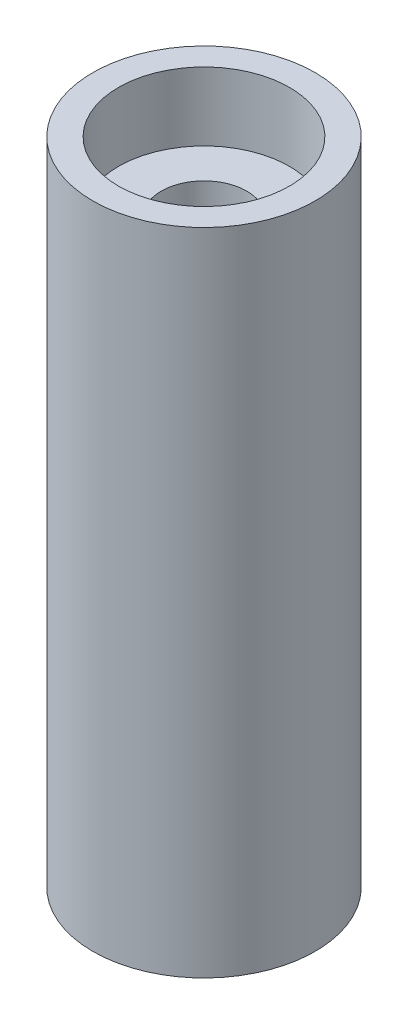
ISO-10303-21;
HEADER;
FILE_DESCRIPTION(('STEP AP214'),'2;1');
FILE_NAME('part.step','',(''),(''),'','','');
FILE_SCHEMA(('AUTOMOTIVE_DESIGN { 1 0 10303 214 1 1 1 1 }'));
ENDSEC;
DATA;
#1=APPLICATION_CONTEXT('core data for automotive mechanical design processes');
#2=APPLICATION_PROTOCOL_DEFINITION('international standard','automotive_design',2000,#1);
#3=PRODUCT_CONTEXT('',#1,'mechanical');
#4=PRODUCT('Part','Part','',(#3));
#5=PRODUCT_RELATED_PRODUCT_CATEGORY('part','',(#4));
#6=PRODUCT_DEFINITION_FORMATION('','',#4);
#7=PRODUCT_DEFINITION_CONTEXT('part definition',#1,'design');
#8=PRODUCT_DEFINITION('design','',#6,#7);
#9=PRODUCT_DEFINITION_SHAPE('','',#8);
#10=(LENGTH_UNIT() NAMED_UNIT(*) SI_UNIT(.MILLI.,.METRE.));
#11=(NAMED_UNIT(*) PLANE_ANGLE_UNIT() SI_UNIT($,.RADIAN.));
#12=(NAMED_UNIT(*) SI_UNIT($,.STERADIAN.) SOLID_ANGLE_UNIT());
#13=UNCERTAINTY_MEASURE_WITH_UNIT(LENGTH_MEASURE(1.E-05),#10,'distance_accuracy_value','');
#14=(GEOMETRIC_REPRESENTATION_CONTEXT(3) GLOBAL_UNCERTAINTY_ASSIGNED_CONTEXT((#13)) GLOBAL_UNIT_ASSIGNED_CONTEXT((#10,
#11,#12)) REPRESENTATION_CONTEXT('',''));
#15=CARTESIAN_POINT('',(0.,0.,0.));
#16=DIRECTION('',(0.,0.,1.));
#17=DIRECTION('',(1.,0.,0.));
#18=AXIS2_PLACEMENT_3D('',#15,#16,#17);
#19=CARTESIAN_POINT('',(0.,19.,0.));
#20=DIRECTION('',(0.,-1.,0.));
#21=DIRECTION('',(0.,0.,-1.));
#22=AXIS2_PLACEMENT_3D('',#19,#20,#21);
#23=CYLINDRICAL_SURFACE('',#22,2.5);
#24=CARTESIAN_POINT('',(0.,15.,0.));
#25=DIRECTION('',(0.,1.,0.));
#26=DIRECTION('',(0.,0.,1.));
#27=AXIS2_PLACEMENT_3D('',#24,#25,#26);
#28=CIRCLE('',#27,2.5);
#29=CARTESIAN_POINT('',(0.,15.,2.5));
#30=VERTEX_POINT('',#29);
#31=EDGE_CURVE('E47',#30,#30,#28,.T.);
#32=ORIENTED_EDGE('',*,*,#31,.T.);
#33=EDGE_LOOP('',(#32));
#34=FACE_BOUND('',#33,.T.);
#35=CARTESIAN_POINT('',(0.,-15.,0.));
#36=DIRECTION('',(0.,-1.,0.));
#37=DIRECTION('',(0.,0.,-1.));
#38=AXIS2_PLACEMENT_3D('',#35,#36,#37);
#39=CIRCLE('',#38,2.5);
#40=CARTESIAN_POINT('',(0.,-15.,-2.5));
#41=VERTEX_POINT('',#40);
#42=EDGE_CURVE('E38',#41,#41,#39,.T.);
#43=ORIENTED_EDGE('',*,*,#42,.T.);
#44=EDGE_LOOP('',(#43));
#45=FACE_BOUND('',#44,.T.);
#46=ADVANCED_FACE('F34',(#34,#45),#23,.F.);
#47=CARTESIAN_POINT('',(0.,-19.,0.));
#48=DIRECTION('',(0.,1.,0.));
#49=DIRECTION('',(0.,0.,1.));
#50=AXIS2_PLACEMENT_3D('',#47,#48,#49);
#51=PLANE('',#50);
#52=CARTESIAN_POINT('',(0.,-19.,0.));
#53=DIRECTION('',(0.,1.,0.));
#54=DIRECTION('',(0.,0.,1.));
#55=AXIS2_PLACEMENT_3D('',#52,#53,#54);
#56=CIRCLE('',#55,6.5);
#57=CARTESIAN_POINT('',(0.,-19.,6.5));
#58=VERTEX_POINT('',#57);
#59=EDGE_CURVE('E42',#58,#58,#56,.T.);
#60=ORIENTED_EDGE('',*,*,#59,.F.);
#61=EDGE_LOOP('',(#60));
#62=FACE_BOUND('',#61,.T.);
#63=CARTESIAN_POINT('',(0.,-19.,0.));
#64=DIRECTION('',(0.,1.,0.));
#65=DIRECTION('',(0.,0.,1.));
#66=AXIS2_PLACEMENT_3D('',#63,#64,#65);
#67=CIRCLE('',#66,5.);
#68=CARTESIAN_POINT('',(0.,-19.,5.));
#69=VERTEX_POINT('',#68);
#70=EDGE_CURVE('E61',#69,#69,#67,.T.);
#71=ORIENTED_EDGE('',*,*,#70,.T.);
#72=EDGE_LOOP('',(#71));
#73=FACE_BOUND('',#72,.T.);
#74=ADVANCED_FACE('F83',(#62,#73),#51,.F.);
#75=CARTESIAN_POINT('',(0.,19.,0.));
#76=DIRECTION('',(0.,1.,0.));
#77=DIRECTION('',(0.,0.,1.));
#78=AXIS2_PLACEMENT_3D('',#75,#76,#77);
#79=PLANE('',#78);
#80=CARTESIAN_POINT('',(0.,19.,0.));
#81=DIRECTION('',(0.,1.,0.));
#82=DIRECTION('',(0.,0.,1.));
#83=AXIS2_PLACEMENT_3D('',#80,#81,#82);
#84=CIRCLE('',#83,5.);
#85=CARTESIAN_POINT('',(0.,19.,5.));
#86=VERTEX_POINT('',#85);
#87=EDGE_CURVE('E50',#86,#86,#84,.T.);
#88=ORIENTED_EDGE('',*,*,#87,.F.);
#89=EDGE_LOOP('',(#88));
#90=FACE_BOUND('',#89,.T.);
#91=CARTESIAN_POINT('',(0.,19.,0.));
#92=DIRECTION('',(0.,1.,0.));
#93=DIRECTION('',(0.,0.,1.));
#94=AXIS2_PLACEMENT_3D('',#91,#92,#93);
#95=CIRCLE('',#94,6.5);
#96=CARTESIAN_POINT('',(0.,19.,6.5));
#97=VERTEX_POINT('',#96);
#98=EDGE_CURVE('E10',#97,#97,#95,.T.);
#99=ORIENTED_EDGE('',*,*,#98,.T.);
#100=EDGE_LOOP('',(#99));
#101=FACE_BOUND('',#100,.T.);
#102=ADVANCED_FACE('F88',(#90,#101),#79,.T.);
#103=CARTESIAN_POINT('',(0.,19.,0.));
#104=DIRECTION('',(0.,-1.,0.));
#105=DIRECTION('',(0.,0.,-1.));
#106=AXIS2_PLACEMENT_3D('',#103,#104,#105);
#107=CYLINDRICAL_SURFACE('',#106,6.5);
#108=ORIENTED_EDGE('',*,*,#98,.F.);
#109=EDGE_LOOP('',(#108));
#110=FACE_BOUND('',#109,.T.);
#111=ORIENTED_EDGE('',*,*,#59,.T.);
#112=EDGE_LOOP('',(#111));
#113=FACE_BOUND('',#112,.T.);
#114=ADVANCED_FACE('F36',(#110,#113),#107,.T.);
#115=CARTESIAN_POINT('',(0.,15.,0.));
#116=DIRECTION('',(0.,1.,0.));
#117=DIRECTION('',(0.,0.,1.));
#118=AXIS2_PLACEMENT_3D('',#115,#116,#117);
#119=CYLINDRICAL_SURFACE('',#118,5.);
#120=CARTESIAN_POINT('',(0.,15.,0.));
#121=DIRECTION('',(0.,1.,0.));
#122=DIRECTION('',(0.,0.,1.));
#123=AXIS2_PLACEMENT_3D('',#120,#121,#122);
#124=CIRCLE('',#123,5.);
#125=CARTESIAN_POINT('',(0.,15.,5.));
#126=VERTEX_POINT('',#125);
#127=EDGE_CURVE('E53',#126,#126,#124,.T.);
#128=ORIENTED_EDGE('',*,*,#127,.F.);
#129=EDGE_LOOP('',(#128));
#130=FACE_BOUND('',#129,.T.);
#131=ORIENTED_EDGE('',*,*,#87,.T.);
#132=EDGE_LOOP('',(#131));
#133=FACE_BOUND('',#132,.T.);
#134=ADVANCED_FACE('F92',(#130,#133),#119,.F.);
#135=CARTESIAN_POINT('',(0.,15.,0.));
#136=DIRECTION('',(0.,1.,0.));
#137=DIRECTION('',(0.,0.,1.));
#138=AXIS2_PLACEMENT_3D('',#135,#136,#137);
#139=PLANE('',#138);
#140=ORIENTED_EDGE('',*,*,#31,.F.);
#141=EDGE_LOOP('',(#140));
#142=FACE_BOUND('',#141,.T.);
#143=ORIENTED_EDGE('',*,*,#127,.T.);
#144=EDGE_LOOP('',(#143));
#145=FACE_BOUND('',#144,.T.);
#146=ADVANCED_FACE('F80',(#142,#145),#139,.T.);
#147=CARTESIAN_POINT('',(0.,-15.,0.));
#148=DIRECTION('',(0.,-1.,0.));
#149=DIRECTION('',(0.,0.,-1.));
#150=AXIS2_PLACEMENT_3D('',#147,#148,#149);
#151=CYLINDRICAL_SURFACE('',#150,5.);
#152=CARTESIAN_POINT('',(0.,-15.,0.));
#153=DIRECTION('',(0.,1.,0.));
#154=DIRECTION('',(0.,0.,1.));
#155=AXIS2_PLACEMENT_3D('',#152,#153,#154);
#156=CIRCLE('',#155,5.);
#157=CARTESIAN_POINT('',(0.,-15.,5.));
#158=VERTEX_POINT('',#157);
#159=EDGE_CURVE('E64',#158,#158,#156,.T.);
#160=ORIENTED_EDGE('',*,*,#159,.T.);
#161=EDGE_LOOP('',(#160));
#162=FACE_BOUND('',#161,.T.);
#163=ORIENTED_EDGE('',*,*,#70,.F.);
#164=EDGE_LOOP('',(#163));
#165=FACE_BOUND('',#164,.T.);
#166=ADVANCED_FACE('F75',(#162,#165),#151,.F.);
#167=CARTESIAN_POINT('',(0.,-15.,0.));
#168=DIRECTION('',(0.,-1.,0.));
#169=DIRECTION('',(0.,0.,1.));
#170=AXIS2_PLACEMENT_3D('',#167,#168,#169);
#171=PLANE('',#170);
#172=ORIENTED_EDGE('',*,*,#42,.F.);
#173=EDGE_LOOP('',(#172));
#174=FACE_BOUND('',#173,.T.);
#175=ORIENTED_EDGE('',*,*,#159,.F.);
#176=EDGE_LOOP('',(#175));
#177=FACE_BOUND('',#176,.T.);
#178=ADVANCED_FACE('F72',(#174,#177),#171,.T.);
#179=CLOSED_SHELL('',(#46,#74,#102,#114,#134,#146,#166,#178));
#180=MANIFOLD_SOLID_BREP('B2',#179);
#181=ADVANCED_BREP_SHAPE_REPRESENTATION('',(#18,#180),#14);
#182=SHAPE_DEFINITION_REPRESENTATION(#9,#181);
ENDSEC;
END-ISO-10303-21;
